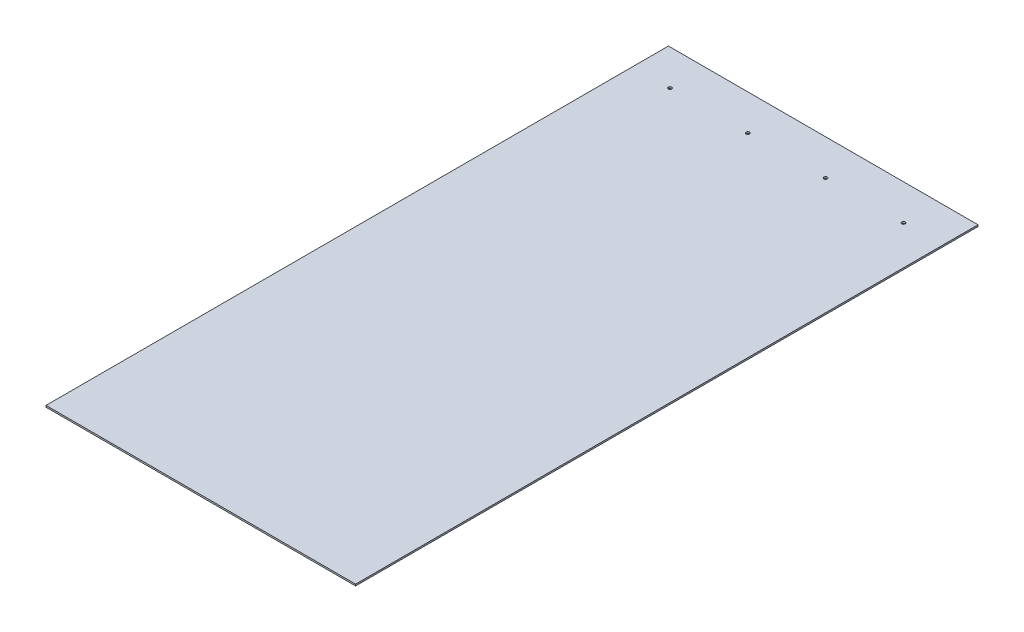
ISO-10303-21;
HEADER;
FILE_DESCRIPTION(('STEP AP214'),'2;1');
FILE_NAME('part.step','',(''),(''),'','','');
FILE_SCHEMA(('AUTOMOTIVE_DESIGN { 1 0 10303 214 1 1 1 1 }'));
ENDSEC;
DATA;
#1=APPLICATION_CONTEXT('core data for automotive mechanical design processes');
#2=APPLICATION_PROTOCOL_DEFINITION('international standard','automotive_design',2000,#1);
#3=PRODUCT_CONTEXT('',#1,'mechanical');
#4=PRODUCT('Part','Part','',(#3));
#5=PRODUCT_RELATED_PRODUCT_CATEGORY('part','',(#4));
#6=PRODUCT_DEFINITION_FORMATION('','',#4);
#7=PRODUCT_DEFINITION_CONTEXT('part definition',#1,'design');
#8=PRODUCT_DEFINITION('design','',#6,#7);
#9=PRODUCT_DEFINITION_SHAPE('','',#8);
#10=(LENGTH_UNIT() NAMED_UNIT(*) SI_UNIT(.MILLI.,.METRE.));
#11=(NAMED_UNIT(*) PLANE_ANGLE_UNIT() SI_UNIT($,.RADIAN.));
#12=(NAMED_UNIT(*) SI_UNIT($,.STERADIAN.) SOLID_ANGLE_UNIT());
#13=UNCERTAINTY_MEASURE_WITH_UNIT(LENGTH_MEASURE(1.E-05),#10,'distance_accuracy_value','');
#14=(GEOMETRIC_REPRESENTATION_CONTEXT(3) GLOBAL_UNCERTAINTY_ASSIGNED_CONTEXT((#13)) GLOBAL_UNIT_ASSIGNED_CONTEXT((#10,
#11,#12)) REPRESENTATION_CONTEXT('',''));
#15=CARTESIAN_POINT('',(0.,0.,0.));
#16=DIRECTION('',(0.,0.,1.));
#17=DIRECTION('',(1.,0.,0.));
#18=AXIS2_PLACEMENT_3D('',#15,#16,#17);
#19=CARTESIAN_POINT('',(0.,3.175,0.));
#20=DIRECTION('',(0.,1.,0.));
#21=DIRECTION('',(0.,0.,1.));
#22=AXIS2_PLACEMENT_3D('',#19,#20,#21);
#23=PLANE('',#22);
#24=CARTESIAN_POINT('',(530.225,3.175,-1149.35));
#25=DIRECTION('',(0.,1.,0.));
#26=DIRECTION('',(0.,0.,1.));
#27=AXIS2_PLACEMENT_3D('',#24,#25,#26);
#28=CIRCLE('',#27,3.3655);
#29=CARTESIAN_POINT('',(530.225,3.175,-1145.9845));
#30=VERTEX_POINT('',#29);
#31=EDGE_CURVE('E92',#30,#30,#28,.F.);
#32=ORIENTED_EDGE('',*,*,#31,.T.);
#33=EDGE_LOOP('',(#32));
#34=FACE_BOUND('',#33,.T.);
#35=CARTESIAN_POINT('',(377.825,3.175,-1149.35));
#36=DIRECTION('',(0.,1.,0.));
#37=DIRECTION('',(0.,0.,1.));
#38=AXIS2_PLACEMENT_3D('',#35,#36,#37);
#39=CIRCLE('',#38,3.3655);
#40=CARTESIAN_POINT('',(377.825,3.175,-1145.9845));
#41=VERTEX_POINT('',#40);
#42=EDGE_CURVE('E95',#41,#41,#39,.F.);
#43=ORIENTED_EDGE('',*,*,#42,.T.);
#44=EDGE_LOOP('',(#43));
#45=FACE_BOUND('',#44,.T.);
#46=CARTESIAN_POINT('',(225.425,3.175,-1149.35));
#47=DIRECTION('',(0.,1.,0.));
#48=DIRECTION('',(0.,0.,1.));
#49=AXIS2_PLACEMENT_3D('',#46,#47,#48);
#50=CIRCLE('',#49,3.3655);
#51=CARTESIAN_POINT('',(225.425,3.175,-1145.9845));
#52=VERTEX_POINT('',#51);
#53=EDGE_CURVE('E97',#52,#52,#50,.F.);
#54=ORIENTED_EDGE('',*,*,#53,.T.);
#55=EDGE_LOOP('',(#54));
#56=FACE_BOUND('',#55,.T.);
#57=CARTESIAN_POINT('',(73.025,3.175,-1149.35));
#58=DIRECTION('',(0.,1.,0.));
#59=DIRECTION('',(0.,0.,1.));
#60=AXIS2_PLACEMENT_3D('',#57,#58,#59);
#61=CIRCLE('',#60,3.3655);
#62=CARTESIAN_POINT('',(73.025,3.175,-1145.9845));
#63=VERTEX_POINT('',#62);
#64=EDGE_CURVE('E20',#63,#63,#61,.F.);
#65=ORIENTED_EDGE('',*,*,#64,.T.);
#66=EDGE_LOOP('',(#65));
#67=FACE_BOUND('',#66,.T.);
#68=DIRECTION('',(0.,0.,1.));
#69=VECTOR('',#68,1.);
#70=CARTESIAN_POINT('',(0.,3.175,-1219.2));
#71=LINE('',#70,#69);
#72=CARTESIAN_POINT('',(0.,3.175,0.));
#73=VERTEX_POINT('',#72);
#74=CARTESIAN_POINT('',(0.,3.175,-1219.2));
#75=VERTEX_POINT('',#74);
#76=EDGE_CURVE('E71',#73,#75,#71,.F.);
#77=ORIENTED_EDGE('',*,*,#76,.F.);
#78=DIRECTION('',(1.,0.,0.));
#79=VECTOR('',#78,1.);
#80=CARTESIAN_POINT('',(0.,3.175,0.));
#81=LINE('',#80,#79);
#82=CARTESIAN_POINT('',(606.425,3.175,0.));
#83=VERTEX_POINT('',#82);
#84=EDGE_CURVE('E68',#83,#73,#81,.F.);
#85=ORIENTED_EDGE('',*,*,#84,.F.);
#86=DIRECTION('',(0.,0.,-1.));
#87=VECTOR('',#86,1.);
#88=CARTESIAN_POINT('',(606.425,3.175,0.));
#89=LINE('',#88,#87);
#90=CARTESIAN_POINT('',(606.425,3.175,-1219.2));
#91=VERTEX_POINT('',#90);
#92=EDGE_CURVE('E59',#91,#83,#89,.F.);
#93=ORIENTED_EDGE('',*,*,#92,.F.);
#94=DIRECTION('',(-1.,0.,0.));
#95=VECTOR('',#94,1.);
#96=CARTESIAN_POINT('',(606.425,3.175,-1219.2));
#97=LINE('',#96,#95);
#98=EDGE_CURVE('E54',#75,#91,#97,.F.);
#99=ORIENTED_EDGE('',*,*,#98,.F.);
#100=EDGE_LOOP('',(#77,#85,#93,#99));
#101=FACE_BOUND('',#100,.T.);
#102=ADVANCED_FACE('F17',(#34,#45,#56,#67,#101),#23,.T.);
#103=CARTESIAN_POINT('',(0.,0.,0.));
#104=DIRECTION('',(0.,0.,1.));
#105=DIRECTION('',(1.,0.,0.));
#106=AXIS2_PLACEMENT_3D('',#103,#104,#105);
#107=PLANE('',#106);
#108=DIRECTION('',(0.,1.,0.));
#109=VECTOR('',#108,1.);
#110=CARTESIAN_POINT('',(0.,0.,0.));
#111=LINE('',#110,#109);
#112=CARTESIAN_POINT('',(0.,0.,0.));
#113=VERTEX_POINT('',#112);
#114=EDGE_CURVE('E105',#113,#73,#111,.T.);
#115=ORIENTED_EDGE('',*,*,#114,.F.);
#116=DIRECTION('',(1.,0.,0.));
#117=VECTOR('',#116,1.);
#118=CARTESIAN_POINT('',(0.,0.,0.));
#119=LINE('',#118,#117);
#120=CARTESIAN_POINT('',(606.425,0.,0.));
#121=VERTEX_POINT('',#120);
#122=EDGE_CURVE('E78',#113,#121,#119,.T.);
#123=ORIENTED_EDGE('',*,*,#122,.T.);
#124=DIRECTION('',(0.,1.,0.));
#125=VECTOR('',#124,1.);
#126=CARTESIAN_POINT('',(606.425,0.,0.));
#127=LINE('',#126,#125);
#128=EDGE_CURVE('E64',#83,#121,#127,.F.);
#129=ORIENTED_EDGE('',*,*,#128,.F.);
#130=ORIENTED_EDGE('',*,*,#84,.T.);
#131=EDGE_LOOP('',(#115,#123,#129,#130));
#132=FACE_BOUND('',#131,.T.);
#133=ADVANCED_FACE('F77',(#132),#107,.T.);
#134=CARTESIAN_POINT('',(606.425,0.,0.));
#135=DIRECTION('',(1.,0.,0.));
#136=DIRECTION('',(0.,0.,-1.));
#137=AXIS2_PLACEMENT_3D('',#134,#135,#136);
#138=PLANE('',#137);
#139=ORIENTED_EDGE('',*,*,#128,.T.);
#140=DIRECTION('',(0.,0.,1.));
#141=VECTOR('',#140,1.);
#142=CARTESIAN_POINT('',(606.425,0.,0.));
#143=LINE('',#142,#141);
#144=CARTESIAN_POINT('',(606.425,0.,-1219.2));
#145=VERTEX_POINT('',#144);
#146=EDGE_CURVE('E116',#121,#145,#143,.F.);
#147=ORIENTED_EDGE('',*,*,#146,.T.);
#148=DIRECTION('',(0.,1.,0.));
#149=VECTOR('',#148,1.);
#150=CARTESIAN_POINT('',(606.425,0.,-1219.2));
#151=LINE('',#150,#149);
#152=EDGE_CURVE('E66',#91,#145,#151,.F.);
#153=ORIENTED_EDGE('',*,*,#152,.F.);
#154=ORIENTED_EDGE('',*,*,#92,.T.);
#155=EDGE_LOOP('',(#139,#147,#153,#154));
#156=FACE_BOUND('',#155,.T.);
#157=ADVANCED_FACE('F61',(#156),#138,.T.);
#158=CARTESIAN_POINT('',(606.425,0.,-1219.2));
#159=DIRECTION('',(0.,0.,-1.));
#160=DIRECTION('',(-1.,0.,0.));
#161=AXIS2_PLACEMENT_3D('',#158,#159,#160);
#162=PLANE('',#161);
#163=ORIENTED_EDGE('',*,*,#152,.T.);
#164=DIRECTION('',(1.,0.,0.));
#165=VECTOR('',#164,1.);
#166=CARTESIAN_POINT('',(0.,0.,-1219.2));
#167=LINE('',#166,#165);
#168=CARTESIAN_POINT('',(0.,0.,-1219.2));
#169=VERTEX_POINT('',#168);
#170=EDGE_CURVE('E113',#145,#169,#167,.F.);
#171=ORIENTED_EDGE('',*,*,#170,.T.);
#172=DIRECTION('',(0.,1.,0.));
#173=VECTOR('',#172,1.);
#174=CARTESIAN_POINT('',(0.,0.,-1219.2));
#175=LINE('',#174,#173);
#176=EDGE_CURVE('E35',#75,#169,#175,.F.);
#177=ORIENTED_EDGE('',*,*,#176,.F.);
#178=ORIENTED_EDGE('',*,*,#98,.T.);
#179=EDGE_LOOP('',(#163,#171,#177,#178));
#180=FACE_BOUND('',#179,.T.);
#181=ADVANCED_FACE('F112',(#180),#162,.T.);
#182=CARTESIAN_POINT('',(0.,0.,-1219.2));
#183=DIRECTION('',(-1.,0.,0.));
#184=DIRECTION('',(0.,0.,1.));
#185=AXIS2_PLACEMENT_3D('',#182,#183,#184);
#186=PLANE('',#185);
#187=ORIENTED_EDGE('',*,*,#176,.T.);
#188=DIRECTION('',(0.,0.,1.));
#189=VECTOR('',#188,1.);
#190=CARTESIAN_POINT('',(0.,0.,0.));
#191=LINE('',#190,#189);
#192=EDGE_CURVE('E91',#169,#113,#191,.T.);
#193=ORIENTED_EDGE('',*,*,#192,.T.);
#194=ORIENTED_EDGE('',*,*,#114,.T.);
#195=ORIENTED_EDGE('',*,*,#76,.T.);
#196=EDGE_LOOP('',(#187,#193,#194,#195));
#197=FACE_BOUND('',#196,.T.);
#198=ADVANCED_FACE('F119',(#197),#186,.T.);
#199=CARTESIAN_POINT('',(73.025,3.175,-1149.35));
#200=DIRECTION('',(0.,1.,0.));
#201=DIRECTION('',(0.,0.,1.));
#202=AXIS2_PLACEMENT_3D('',#199,#200,#201);
#203=CYLINDRICAL_SURFACE('',#202,3.3655);
#204=ORIENTED_EDGE('',*,*,#64,.F.);
#205=EDGE_LOOP('',(#204));
#206=FACE_BOUND('',#205,.T.);
#207=CARTESIAN_POINT('',(73.025,0.,-1149.35));
#208=DIRECTION('',(0.,1.,0.));
#209=DIRECTION('',(0.,0.,1.));
#210=AXIS2_PLACEMENT_3D('',#207,#208,#209);
#211=CIRCLE('',#210,3.3655);
#212=CARTESIAN_POINT('',(73.025,0.,-1145.9845));
#213=VERTEX_POINT('',#212);
#214=EDGE_CURVE('E88',#213,#213,#211,.F.);
#215=ORIENTED_EDGE('',*,*,#214,.T.);
#216=EDGE_LOOP('',(#215));
#217=FACE_BOUND('',#216,.T.);
#218=ADVANCED_FACE('F121',(#206,#217),#203,.F.);
#219=CARTESIAN_POINT('',(225.425,3.175,-1149.35));
#220=DIRECTION('',(0.,1.,0.));
#221=DIRECTION('',(0.,0.,1.));
#222=AXIS2_PLACEMENT_3D('',#219,#220,#221);
#223=CYLINDRICAL_SURFACE('',#222,3.3655);
#224=ORIENTED_EDGE('',*,*,#53,.F.);
#225=EDGE_LOOP('',(#224));
#226=FACE_BOUND('',#225,.T.);
#227=CARTESIAN_POINT('',(225.425,0.,-1149.35));
#228=DIRECTION('',(0.,1.,0.));
#229=DIRECTION('',(0.,0.,1.));
#230=AXIS2_PLACEMENT_3D('',#227,#228,#229);
#231=CIRCLE('',#230,3.3655);
#232=CARTESIAN_POINT('',(225.425,0.,-1145.9845));
#233=VERTEX_POINT('',#232);
#234=EDGE_CURVE('E85',#233,#233,#231,.F.);
#235=ORIENTED_EDGE('',*,*,#234,.T.);
#236=EDGE_LOOP('',(#235));
#237=FACE_BOUND('',#236,.T.);
#238=ADVANCED_FACE('F128',(#226,#237),#223,.F.);
#239=CARTESIAN_POINT('',(377.825,3.175,-1149.35));
#240=DIRECTION('',(0.,1.,0.));
#241=DIRECTION('',(0.,0.,1.));
#242=AXIS2_PLACEMENT_3D('',#239,#240,#241);
#243=CYLINDRICAL_SURFACE('',#242,3.3655);
#244=ORIENTED_EDGE('',*,*,#42,.F.);
#245=EDGE_LOOP('',(#244));
#246=FACE_BOUND('',#245,.T.);
#247=CARTESIAN_POINT('',(377.825,0.,-1149.35));
#248=DIRECTION('',(0.,1.,0.));
#249=DIRECTION('',(0.,0.,1.));
#250=AXIS2_PLACEMENT_3D('',#247,#248,#249);
#251=CIRCLE('',#250,3.3655);
#252=CARTESIAN_POINT('',(377.825,0.,-1145.9845));
#253=VERTEX_POINT('',#252);
#254=EDGE_CURVE('E26',#253,#253,#251,.F.);
#255=ORIENTED_EDGE('',*,*,#254,.T.);
#256=EDGE_LOOP('',(#255));
#257=FACE_BOUND('',#256,.T.);
#258=ADVANCED_FACE('F139',(#246,#257),#243,.F.);
#259=CARTESIAN_POINT('',(530.225,3.175,-1149.35));
#260=DIRECTION('',(0.,1.,0.));
#261=DIRECTION('',(0.,0.,1.));
#262=AXIS2_PLACEMENT_3D('',#259,#260,#261);
#263=CYLINDRICAL_SURFACE('',#262,3.3655);
#264=ORIENTED_EDGE('',*,*,#31,.F.);
#265=EDGE_LOOP('',(#264));
#266=FACE_BOUND('',#265,.T.);
#267=CARTESIAN_POINT('',(530.225,0.,-1149.35));
#268=DIRECTION('',(0.,1.,0.));
#269=DIRECTION('',(0.,0.,1.));
#270=AXIS2_PLACEMENT_3D('',#267,#268,#269);
#271=CIRCLE('',#270,3.3655);
#272=CARTESIAN_POINT('',(530.225,0.,-1145.9845));
#273=VERTEX_POINT('',#272);
#274=EDGE_CURVE('E11',#273,#273,#271,.F.);
#275=ORIENTED_EDGE('',*,*,#274,.T.);
#276=EDGE_LOOP('',(#275));
#277=FACE_BOUND('',#276,.T.);
#278=ADVANCED_FACE('F133',(#266,#277),#263,.F.);
#279=CARTESIAN_POINT('',(0.,0.,0.));
#280=DIRECTION('',(0.,1.,0.));
#281=DIRECTION('',(0.,0.,1.));
#282=AXIS2_PLACEMENT_3D('',#279,#280,#281);
#283=PLANE('',#282);
#284=ORIENTED_EDGE('',*,*,#274,.F.);
#285=EDGE_LOOP('',(#284));
#286=FACE_BOUND('',#285,.T.);
#287=ORIENTED_EDGE('',*,*,#254,.F.);
#288=EDGE_LOOP('',(#287));
#289=FACE_BOUND('',#288,.T.);
#290=ORIENTED_EDGE('',*,*,#234,.F.);
#291=EDGE_LOOP('',(#290));
#292=FACE_BOUND('',#291,.T.);
#293=ORIENTED_EDGE('',*,*,#214,.F.);
#294=EDGE_LOOP('',(#293));
#295=FACE_BOUND('',#294,.T.);
#296=ORIENTED_EDGE('',*,*,#170,.F.);
#297=ORIENTED_EDGE('',*,*,#146,.F.);
#298=ORIENTED_EDGE('',*,*,#122,.F.);
#299=ORIENTED_EDGE('',*,*,#192,.F.);
#300=EDGE_LOOP('',(#296,#297,#298,#299));
#301=FACE_BOUND('',#300,.T.);
#302=ADVANCED_FACE('F115',(#286,#289,#292,#295,#301),#283,.F.);
#303=CLOSED_SHELL('',(#102,#133,#157,#181,#198,#218,#238,#258,#278,#302));
#304=MANIFOLD_SOLID_BREP('B1',#303);
#305=ADVANCED_BREP_SHAPE_REPRESENTATION('',(#18,#304),#14);
#306=SHAPE_DEFINITION_REPRESENTATION(#9,#305);
ENDSEC;
END-ISO-10303-21;
